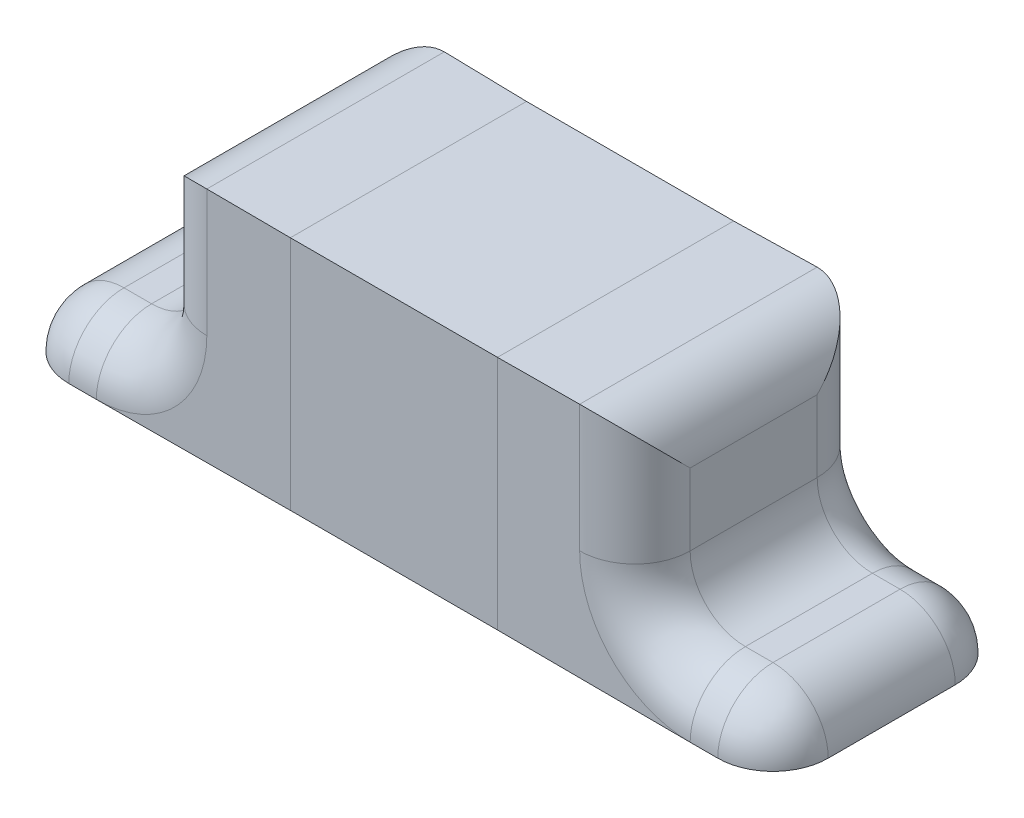
ISO-10303-21;
HEADER;
FILE_DESCRIPTION(('STEP AP214'),'2;1');
FILE_NAME('part.step','',(''),(''),'','','');
FILE_SCHEMA(('AUTOMOTIVE_DESIGN { 1 0 10303 214 1 1 1 1 }'));
ENDSEC;
DATA;
#1=APPLICATION_CONTEXT('core data for automotive mechanical design processes');
#2=APPLICATION_PROTOCOL_DEFINITION('international standard','automotive_design',2000,#1);
#3=PRODUCT_CONTEXT('',#1,'mechanical');
#4=PRODUCT('Part','Part','',(#3));
#5=PRODUCT_RELATED_PRODUCT_CATEGORY('part','',(#4));
#6=PRODUCT_DEFINITION_FORMATION('','',#4);
#7=PRODUCT_DEFINITION_CONTEXT('part definition',#1,'design');
#8=PRODUCT_DEFINITION('design','',#6,#7);
#9=PRODUCT_DEFINITION_SHAPE('','',#8);
#10=(LENGTH_UNIT() NAMED_UNIT(*) SI_UNIT(.MILLI.,.METRE.));
#11=(NAMED_UNIT(*) PLANE_ANGLE_UNIT() SI_UNIT($,.RADIAN.));
#12=(NAMED_UNIT(*) SI_UNIT($,.STERADIAN.) SOLID_ANGLE_UNIT());
#13=UNCERTAINTY_MEASURE_WITH_UNIT(LENGTH_MEASURE(1.E-05),#10,'distance_accuracy_value','');
#14=(GEOMETRIC_REPRESENTATION_CONTEXT(3) GLOBAL_UNCERTAINTY_ASSIGNED_CONTEXT((#13)) GLOBAL_UNIT_ASSIGNED_CONTEXT((#10,
#11,#12)) REPRESENTATION_CONTEXT('',''));
#15=CARTESIAN_POINT('',(0.,0.,0.));
#16=DIRECTION('',(0.,0.,1.));
#17=DIRECTION('',(1.,0.,0.));
#18=AXIS2_PLACEMENT_3D('',#15,#16,#17);
#19=CARTESIAN_POINT('',(-1.175,-0.00155700990971797,0.23));
#20=DIRECTION('',(0.,1.,0.));
#21=DIRECTION('',(1.,0.,0.));
#22=AXIS2_PLACEMENT_3D('',#19,#20,#21);
#23=SPHERICAL_SURFACE('',#22,0.2);
#24=CARTESIAN_POINT('',(-1.175,-0.00155700990971796,0.23));
#25=DIRECTION('',(0.,-1.,0.));
#26=DIRECTION('',(0.,0.,-1.));
#27=AXIS2_PLACEMENT_3D('',#24,#25,#26);
#28=CIRCLE('',#27,0.2);
#29=CARTESIAN_POINT('',(-1.175,-0.00155700990971797,0.43));
#30=VERTEX_POINT('',#29);
#31=CARTESIAN_POINT('',(-1.375,-0.00155700990971797,0.23));
#32=VERTEX_POINT('',#31);
#33=EDGE_CURVE('E244',#30,#32,#28,.T.);
#34=ORIENTED_EDGE('',*,*,#33,.F.);
#35=CARTESIAN_POINT('',(-1.175,-0.00155700990971797,0.23));
#36=DIRECTION('',(1.,0.,0.));
#37=DIRECTION('',(0.,0.,-1.));
#38=AXIS2_PLACEMENT_3D('',#35,#36,#37);
#39=CIRCLE('',#38,0.2);
#40=CARTESIAN_POINT('',(-1.175,0.198442990090282,0.23));
#41=VERTEX_POINT('',#40);
#42=EDGE_CURVE('E261',#41,#30,#39,.T.);
#43=ORIENTED_EDGE('',*,*,#42,.F.);
#44=CARTESIAN_POINT('',(-1.175,-0.00155700990971797,0.23));
#45=DIRECTION('',(0.,0.,-1.));
#46=DIRECTION('',(-1.,0.,0.));
#47=AXIS2_PLACEMENT_3D('',#44,#45,#46);
#48=CIRCLE('',#47,0.2);
#49=EDGE_CURVE('E221',#32,#41,#48,.T.);
#50=ORIENTED_EDGE('',*,*,#49,.F.);
#51=EDGE_LOOP('',(#34,#43,#50));
#52=FACE_BOUND('',#51,.T.);
#53=ADVANCED_FACE('F18',(#52),#23,.T.);
#54=CARTESIAN_POINT('',(-1.175,-0.00155700990971797,-0.23));
#55=DIRECTION('',(0.,1.,0.));
#56=DIRECTION('',(1.,0.,0.));
#57=AXIS2_PLACEMENT_3D('',#54,#55,#56);
#58=SPHERICAL_SURFACE('',#57,0.2);
#59=CARTESIAN_POINT('',(-1.175,-0.00155700990971793,-0.23));
#60=DIRECTION('',(0.,-1.,0.));
#61=DIRECTION('',(0.,0.,-1.));
#62=AXIS2_PLACEMENT_3D('',#59,#60,#61);
#63=CIRCLE('',#62,0.2);
#64=CARTESIAN_POINT('',(-1.375,-0.00155700990971797,-0.23));
#65=VERTEX_POINT('',#64);
#66=CARTESIAN_POINT('',(-1.175,-0.00155700990971791,-0.43));
#67=VERTEX_POINT('',#66);
#68=EDGE_CURVE('E537',#65,#67,#63,.T.);
#69=ORIENTED_EDGE('',*,*,#68,.F.);
#70=CARTESIAN_POINT('',(-1.175,-0.00155700990971797,-0.23));
#71=DIRECTION('',(0.,0.,1.));
#72=DIRECTION('',(-1.,0.,0.));
#73=AXIS2_PLACEMENT_3D('',#70,#71,#72);
#74=CIRCLE('',#73,0.2);
#75=CARTESIAN_POINT('',(-1.175,0.198442990090282,-0.23));
#76=VERTEX_POINT('',#75);
#77=EDGE_CURVE('E615',#76,#65,#74,.T.);
#78=ORIENTED_EDGE('',*,*,#77,.F.);
#79=CARTESIAN_POINT('',(-1.175,-0.00155700990971797,-0.23));
#80=DIRECTION('',(1.,0.,0.));
#81=DIRECTION('',(0.,0.,-1.));
#82=AXIS2_PLACEMENT_3D('',#79,#80,#81);
#83=CIRCLE('',#82,0.2);
#84=EDGE_CURVE('E46',#67,#76,#83,.T.);
#85=ORIENTED_EDGE('',*,*,#84,.F.);
#86=EDGE_LOOP('',(#69,#78,#85));
#87=FACE_BOUND('',#86,.T.);
#88=ADVANCED_FACE('F796',(#87),#58,.T.);
#89=CARTESIAN_POINT('',(-0.675,-0.00155700990971791,-0.23));
#90=DIRECTION('',(0.,-1.,0.));
#91=DIRECTION('',(0.,0.,-1.));
#92=AXIS2_PLACEMENT_3D('',#89,#90,#91);
#93=CYLINDRICAL_SURFACE('',#92,0.2);
#94=CARTESIAN_POINT('',(-0.675,0.398442990090282,-0.23));
#95=DIRECTION('',(0.,1.,0.));
#96=DIRECTION('',(0.,0.,-1.));
#97=AXIS2_PLACEMENT_3D('',#94,#95,#96);
#98=CIRCLE('',#97,0.2);
#99=CARTESIAN_POINT('',(-0.675,0.398442990090282,-0.43));
#100=VERTEX_POINT('',#99);
#101=CARTESIAN_POINT('',(-0.875,0.398442990090282,-0.23));
#102=VERTEX_POINT('',#101);
#103=EDGE_CURVE('E31',#100,#102,#98,.T.);
#104=ORIENTED_EDGE('',*,*,#103,.T.);
#105=DIRECTION('',(0.,-1.,0.));
#106=VECTOR('',#105,1.);
#107=CARTESIAN_POINT('',(-0.875,0.198442990090282,-0.23));
#108=LINE('',#107,#106);
#109=CARTESIAN_POINT('',(-0.875,0.658442990090282,-0.23));
#110=VERTEX_POINT('',#109);
#111=EDGE_CURVE('E254',#110,#102,#108,.T.);
#112=ORIENTED_EDGE('',*,*,#111,.F.);
#113=CARTESIAN_POINT('',(-0.875,0.658442990090282,-0.23));
#114=CARTESIAN_POINT('',(-0.875,0.775600277615663,-0.347157287525381));
#115=CARTESIAN_POINT('',(-0.792157287525382,0.858442990090282,-0.43));
#116=CARTESIAN_POINT('',(-0.675,0.858442990090282,-0.43));
#117=(BOUNDED_CURVE() B_SPLINE_CURVE(3,(#113,#114,#115,#116),.UNSPECIFIED.,.F.,
.F.) B_SPLINE_CURVE_WITH_KNOTS((4,4),(4.71238898038469,6.28318530717959),
.UNSPECIFIED.) CURVE() GEOMETRIC_REPRESENTATION_ITEM() RATIONAL_B_SPLINE_CURVE((1.,
0.804737854124365,0.804737854124365,1.)) REPRESENTATION_ITEM(''));
#118=CARTESIAN_POINT('',(-0.675,0.858442990090282,-0.43));
#119=VERTEX_POINT('',#118);
#120=EDGE_CURVE('E11',#110,#119,#117,.T.);
#121=ORIENTED_EDGE('',*,*,#120,.T.);
#122=DIRECTION('',(0.,1.,0.));
#123=VECTOR('',#122,1.);
#124=CARTESIAN_POINT('',(-0.675,0.858442990090282,-0.43));
#125=LINE('',#124,#123);
#126=EDGE_CURVE('E328',#100,#119,#125,.T.);
#127=ORIENTED_EDGE('',*,*,#126,.F.);
#128=EDGE_LOOP('',(#104,#112,#121,#127));
#129=FACE_BOUND('',#128,.T.);
#130=ADVANCED_FACE('F410',(#129),#93,.T.);
#131=CARTESIAN_POINT('',(-0.675,0.658442990090282,0.43));
#132=DIRECTION('',(0.,0.,-1.));
#133=DIRECTION('',(-1.,0.,0.));
#134=AXIS2_PLACEMENT_3D('',#131,#132,#133);
#135=CYLINDRICAL_SURFACE('',#134,0.2);
#136=CARTESIAN_POINT('',(-0.875,0.658442990090282,0.23));
#137=CARTESIAN_POINT('',(-0.875,0.775600277615663,0.347157287525381));
#138=CARTESIAN_POINT('',(-0.792157287525382,0.858442990090282,0.43));
#139=CARTESIAN_POINT('',(-0.675,0.858442990090282,0.43));
#140=(BOUNDED_CURVE() B_SPLINE_CURVE(3,(#136,#137,#138,#139),.UNSPECIFIED.,.F.,
.F.) B_SPLINE_CURVE_WITH_KNOTS((4,4),(1.5707963267949,3.1415926535898),
.UNSPECIFIED.) CURVE() GEOMETRIC_REPRESENTATION_ITEM() RATIONAL_B_SPLINE_CURVE((1.,
0.804737854124365,0.804737854124365,1.)) REPRESENTATION_ITEM(''));
#141=CARTESIAN_POINT('',(-0.875,0.658442990090282,0.23));
#142=VERTEX_POINT('',#141);
#143=CARTESIAN_POINT('',(-0.675,0.858442990090282,0.43));
#144=VERTEX_POINT('',#143);
#145=EDGE_CURVE('E530',#142,#144,#140,.T.);
#146=ORIENTED_EDGE('',*,*,#145,.T.);
#147=DIRECTION('',(0.,0.,1.));
#148=VECTOR('',#147,1.);
#149=CARTESIAN_POINT('',(-0.675,0.858442990090282,0.43));
#150=LINE('',#149,#148);
#151=EDGE_CURVE('E233',#119,#144,#150,.T.);
#152=ORIENTED_EDGE('',*,*,#151,.F.);
#153=ORIENTED_EDGE('',*,*,#120,.F.);
#154=DIRECTION('',(0.,0.,-1.));
#155=VECTOR('',#154,1.);
#156=CARTESIAN_POINT('',(-0.875,0.658442990090282,-0.43));
#157=LINE('',#156,#155);
#158=EDGE_CURVE('E616',#142,#110,#157,.T.);
#159=ORIENTED_EDGE('',*,*,#158,.F.);
#160=EDGE_LOOP('',(#146,#152,#153,#159));
#161=FACE_BOUND('',#160,.T.);
#162=ADVANCED_FACE('F406',(#161),#135,.T.);
#163=CARTESIAN_POINT('',(-1.075,0.398442990090282,-0.23));
#164=DIRECTION('',(0.,0.,-1.));
#165=DIRECTION('',(-1.,0.,0.));
#166=AXIS2_PLACEMENT_3D('',#163,#164,#165);
#167=TOROIDAL_SURFACE('',#166,0.4,0.2);
#168=CARTESIAN_POINT('',(-1.075,-0.00155700990971797,-0.23));
#169=DIRECTION('',(1.,0.,0.));
#170=DIRECTION('',(0.,0.,-1.));
#171=AXIS2_PLACEMENT_3D('',#168,#169,#170);
#172=CIRCLE('',#171,0.2);
#173=CARTESIAN_POINT('',(-1.075,-0.00155700990971791,-0.43));
#174=VERTEX_POINT('',#173);
#175=CARTESIAN_POINT('',(-1.075,0.198442990090282,-0.23));
#176=VERTEX_POINT('',#175);
#177=EDGE_CURVE('E684',#174,#176,#172,.T.);
#178=ORIENTED_EDGE('',*,*,#177,.T.);
#179=CARTESIAN_POINT('',(-1.075,0.398442990090282,-0.23));
#180=DIRECTION('',(0.,0.,1.));
#181=DIRECTION('',(-1.,0.,0.));
#182=AXIS2_PLACEMENT_3D('',#179,#180,#181);
#183=CIRCLE('',#182,0.2);
#184=EDGE_CURVE('E266',#176,#102,#183,.T.);
#185=ORIENTED_EDGE('',*,*,#184,.T.);
#186=ORIENTED_EDGE('',*,*,#103,.F.);
#187=CARTESIAN_POINT('',(-1.075,0.398442990090282,-0.43));
#188=DIRECTION('',(0.,0.,-1.));
#189=DIRECTION('',(-1.,0.,0.));
#190=AXIS2_PLACEMENT_3D('',#187,#188,#189);
#191=CIRCLE('',#190,0.4);
#192=EDGE_CURVE('E601',#100,#174,#191,.T.);
#193=ORIENTED_EDGE('',*,*,#192,.T.);
#194=EDGE_LOOP('',(#178,#185,#186,#193));
#195=FACE_BOUND('',#194,.T.);
#196=ADVANCED_FACE('F409',(#195),#167,.T.);
#197=CARTESIAN_POINT('',(-0.675,-0.00155700990971797,0.23));
#198=DIRECTION('',(0.,1.,0.));
#199=DIRECTION('',(0.,0.,1.));
#200=AXIS2_PLACEMENT_3D('',#197,#198,#199);
#201=CYLINDRICAL_SURFACE('',#200,0.2);
#202=CARTESIAN_POINT('',(-0.675,0.398442990090282,0.23));
#203=DIRECTION('',(0.,1.,0.));
#204=DIRECTION('',(0.,0.,-1.));
#205=AXIS2_PLACEMENT_3D('',#202,#203,#204);
#206=CIRCLE('',#205,0.2);
#207=CARTESIAN_POINT('',(-0.875,0.398442990090282,0.23));
#208=VERTEX_POINT('',#207);
#209=CARTESIAN_POINT('',(-0.675,0.398442990090282,0.43));
#210=VERTEX_POINT('',#209);
#211=EDGE_CURVE('E210',#208,#210,#206,.T.);
#212=ORIENTED_EDGE('',*,*,#211,.T.);
#213=DIRECTION('',(0.,-1.,0.));
#214=VECTOR('',#213,1.);
#215=CARTESIAN_POINT('',(-0.675,0.198442990090282,0.43));
#216=LINE('',#215,#214);
#217=EDGE_CURVE('E214',#144,#210,#216,.T.);
#218=ORIENTED_EDGE('',*,*,#217,.F.);
#219=ORIENTED_EDGE('',*,*,#145,.F.);
#220=DIRECTION('',(0.,1.,0.));
#221=VECTOR('',#220,1.);
#222=CARTESIAN_POINT('',(-0.875,0.858442990090282,0.23));
#223=LINE('',#222,#221);
#224=EDGE_CURVE('E217',#208,#142,#223,.T.);
#225=ORIENTED_EDGE('',*,*,#224,.F.);
#226=EDGE_LOOP('',(#212,#218,#219,#225));
#227=FACE_BOUND('',#226,.T.);
#228=ADVANCED_FACE('F212',(#227),#201,.T.);
#229=CARTESIAN_POINT('',(-0.875,-0.00155700990971797,-0.23));
#230=DIRECTION('',(1.,0.,0.));
#231=DIRECTION('',(0.,0.,-1.));
#232=AXIS2_PLACEMENT_3D('',#229,#230,#231);
#233=CYLINDRICAL_SURFACE('',#232,0.2);
#234=DIRECTION('',(1.,0.,0.));
#235=VECTOR('',#234,1.);
#236=CARTESIAN_POINT('',(-0.875,-0.00155700990971791,-0.43));
#237=LINE('',#236,#235);
#238=EDGE_CURVE('E301',#67,#174,#237,.T.);
#239=ORIENTED_EDGE('',*,*,#238,.F.);
#240=ORIENTED_EDGE('',*,*,#84,.T.);
#241=DIRECTION('',(-1.,0.,0.));
#242=VECTOR('',#241,1.);
#243=CARTESIAN_POINT('',(-1.375,0.198442990090282,-0.23));
#244=LINE('',#243,#242);
#245=EDGE_CURVE('E280',#176,#76,#244,.T.);
#246=ORIENTED_EDGE('',*,*,#245,.F.);
#247=ORIENTED_EDGE('',*,*,#177,.F.);
#248=EDGE_LOOP('',(#239,#240,#246,#247));
#249=FACE_BOUND('',#248,.T.);
#250=ADVANCED_FACE('F475',(#249),#233,.T.);
#251=CARTESIAN_POINT('',(-1.075,0.398442990090282,0.));
#252=DIRECTION('',(0.,0.,1.));
#253=DIRECTION('',(1.,0.,0.));
#254=AXIS2_PLACEMENT_3D('',#251,#252,#253);
#255=CYLINDRICAL_SURFACE('',#254,0.2);
#256=CARTESIAN_POINT('',(-1.075,0.398442990090282,0.23));
#257=DIRECTION('',(0.,0.,1.));
#258=DIRECTION('',(1.,0.,0.));
#259=AXIS2_PLACEMENT_3D('',#256,#257,#258);
#260=CIRCLE('',#259,0.2);
#261=CARTESIAN_POINT('',(-1.075,0.198442990090282,0.23));
#262=VERTEX_POINT('',#261);
#263=EDGE_CURVE('E199',#262,#208,#260,.T.);
#264=ORIENTED_EDGE('',*,*,#263,.T.);
#265=DIRECTION('',(0.,0.,1.));
#266=VECTOR('',#265,1.);
#267=CARTESIAN_POINT('',(-0.875,0.398442990090282,0.));
#268=LINE('',#267,#266);
#269=EDGE_CURVE('E250',#102,#208,#268,.T.);
#270=ORIENTED_EDGE('',*,*,#269,.F.);
#271=ORIENTED_EDGE('',*,*,#184,.F.);
#272=DIRECTION('',(0.,0.,-1.));
#273=VECTOR('',#272,1.);
#274=CARTESIAN_POINT('',(-1.075,0.198442990090282,0.43));
#275=LINE('',#274,#273);
#276=EDGE_CURVE('E276',#262,#176,#275,.T.);
#277=ORIENTED_EDGE('',*,*,#276,.F.);
#278=EDGE_LOOP('',(#264,#270,#271,#277));
#279=FACE_BOUND('',#278,.T.);
#280=ADVANCED_FACE('F478',(#279),#255,.F.);
#281=CARTESIAN_POINT('',(-1.075,0.398442990090282,0.23));
#282=DIRECTION('',(0.,0.,1.));
#283=DIRECTION('',(1.,0.,0.));
#284=AXIS2_PLACEMENT_3D('',#281,#282,#283);
#285=TOROIDAL_SURFACE('',#284,0.4,0.2);
#286=ORIENTED_EDGE('',*,*,#211,.F.);
#287=ORIENTED_EDGE('',*,*,#263,.F.);
#288=CARTESIAN_POINT('',(-1.075,-0.00155700990971797,0.23));
#289=DIRECTION('',(1.,0.,0.));
#290=DIRECTION('',(0.,0.,-1.));
#291=AXIS2_PLACEMENT_3D('',#288,#289,#290);
#292=CIRCLE('',#291,0.2);
#293=CARTESIAN_POINT('',(-1.075,-0.00155700990971797,0.43));
#294=VERTEX_POINT('',#293);
#295=EDGE_CURVE('E228',#262,#294,#292,.T.);
#296=ORIENTED_EDGE('',*,*,#295,.T.);
#297=CARTESIAN_POINT('',(-1.075,0.398442990090282,0.43));
#298=DIRECTION('',(0.,0.,1.));
#299=DIRECTION('',(1.,0.,0.));
#300=AXIS2_PLACEMENT_3D('',#297,#298,#299);
#301=CIRCLE('',#300,0.4);
#302=EDGE_CURVE('E225',#294,#210,#301,.T.);
#303=ORIENTED_EDGE('',*,*,#302,.T.);
#304=EDGE_LOOP('',(#286,#287,#296,#303));
#305=FACE_BOUND('',#304,.T.);
#306=ADVANCED_FACE('F226',(#305),#285,.T.);
#307=CARTESIAN_POINT('',(-1.175,-0.00155700990971797,0.43));
#308=DIRECTION('',(0.,0.,-1.));
#309=DIRECTION('',(-1.,0.,0.));
#310=AXIS2_PLACEMENT_3D('',#307,#308,#309);
#311=CYLINDRICAL_SURFACE('',#310,0.2);
#312=DIRECTION('',(0.,0.,1.));
#313=VECTOR('',#312,1.);
#314=CARTESIAN_POINT('',(-1.175,0.198442990090282,0.43));
#315=LINE('',#314,#313);
#316=EDGE_CURVE('E265',#76,#41,#315,.T.);
#317=ORIENTED_EDGE('',*,*,#316,.F.);
#318=ORIENTED_EDGE('',*,*,#77,.T.);
#319=DIRECTION('',(0.,0.,-1.));
#320=VECTOR('',#319,1.);
#321=CARTESIAN_POINT('',(-1.375,-0.00155700990971797,0.43));
#322=LINE('',#321,#320);
#323=EDGE_CURVE('E315',#32,#65,#322,.T.);
#324=ORIENTED_EDGE('',*,*,#323,.F.);
#325=ORIENTED_EDGE('',*,*,#49,.T.);
#326=EDGE_LOOP('',(#317,#318,#324,#325));
#327=FACE_BOUND('',#326,.T.);
#328=ADVANCED_FACE('F470',(#327),#311,.T.);
#329=CARTESIAN_POINT('',(-1.375,-0.00155700990971797,0.23));
#330=DIRECTION('',(1.,0.,0.));
#331=DIRECTION('',(0.,0.,-1.));
#332=AXIS2_PLACEMENT_3D('',#329,#330,#331);
#333=CYLINDRICAL_SURFACE('',#332,0.2);
#334=DIRECTION('',(1.,0.,0.));
#335=VECTOR('',#334,1.);
#336=CARTESIAN_POINT('',(-1.375,0.198442990090282,0.23));
#337=LINE('',#336,#335);
#338=EDGE_CURVE('E253',#41,#262,#337,.T.);
#339=ORIENTED_EDGE('',*,*,#338,.F.);
#340=ORIENTED_EDGE('',*,*,#42,.T.);
#341=DIRECTION('',(1.,0.,0.));
#342=VECTOR('',#341,1.);
#343=CARTESIAN_POINT('',(-0.875,-0.00155700990971797,0.43));
#344=LINE('',#343,#342);
#345=EDGE_CURVE('E300',#30,#294,#344,.T.);
#346=ORIENTED_EDGE('',*,*,#345,.T.);
#347=ORIENTED_EDGE('',*,*,#295,.F.);
#348=EDGE_LOOP('',(#339,#340,#346,#347));
#349=FACE_BOUND('',#348,.T.);
#350=ADVANCED_FACE('F473',(#349),#333,.T.);
#351=CARTESIAN_POINT('',(-1.375,0.198442990090282,0.43));
#352=DIRECTION('',(0.,1.,0.));
#353=DIRECTION('',(1.,0.,0.));
#354=AXIS2_PLACEMENT_3D('',#351,#352,#353);
#355=PLANE('',#354);
#356=ORIENTED_EDGE('',*,*,#338,.T.);
#357=ORIENTED_EDGE('',*,*,#276,.T.);
#358=ORIENTED_EDGE('',*,*,#245,.T.);
#359=ORIENTED_EDGE('',*,*,#316,.T.);
#360=EDGE_LOOP('',(#356,#357,#358,#359));
#361=FACE_BOUND('',#360,.T.);
#362=ADVANCED_FACE('F453',(#361),#355,.T.);
#363=CARTESIAN_POINT('',(-0.875,0.,0.));
#364=DIRECTION('',(1.,0.,0.));
#365=DIRECTION('',(0.,1.,0.));
#366=AXIS2_PLACEMENT_3D('',#363,#364,#365);
#367=PLANE('',#366);
#368=ORIENTED_EDGE('',*,*,#224,.T.);
#369=ORIENTED_EDGE('',*,*,#158,.T.);
#370=ORIENTED_EDGE('',*,*,#111,.T.);
#371=ORIENTED_EDGE('',*,*,#269,.T.);
#372=EDGE_LOOP('',(#368,#369,#370,#371));
#373=FACE_BOUND('',#372,.T.);
#374=ADVANCED_FACE('F745',(#373),#367,.F.);
#375=CARTESIAN_POINT('',(-0.875,0.858442990090282,0.43));
#376=DIRECTION('',(0.,1.,0.));
#377=DIRECTION('',(1.,0.,0.));
#378=AXIS2_PLACEMENT_3D('',#375,#376,#377);
#379=PLANE('',#378);
#380=DIRECTION('',(1.,0.,0.));
#381=VECTOR('',#380,1.);
#382=CARTESIAN_POINT('',(-0.875,0.858442990090282,-0.43));
#383=LINE('',#382,#381);
#384=CARTESIAN_POINT('',(-0.375,0.854221495045141,-0.4275));
#385=VERTEX_POINT('',#384);
#386=EDGE_CURVE('E316',#119,#385,#383,.T.);
#387=ORIENTED_EDGE('',*,*,#386,.F.);
#388=ORIENTED_EDGE('',*,*,#151,.T.);
#389=DIRECTION('',(1.,0.,0.));
#390=VECTOR('',#389,1.);
#391=CARTESIAN_POINT('',(-0.875,0.858442990090282,0.43));
#392=LINE('',#391,#390);
#393=CARTESIAN_POINT('',(-0.375,0.854221495045141,0.4275));
#394=VERTEX_POINT('',#393);
#395=EDGE_CURVE('E237',#144,#394,#392,.T.);
#396=ORIENTED_EDGE('',*,*,#395,.T.);
#397=CARTESIAN_POINT('',(-0.375,0.85,-0.4275));
#398=DIRECTION('',(0.,0.,1.));
#399=VECTOR('',#398,1.);
#400=LINE('',#397,#399);
#401=EDGE_CURVE('E294',#385,#394,#400,.T.);
#402=ORIENTED_EDGE('',*,*,#401,.F.);
#403=EDGE_LOOP('',(#387,#388,#396,#402));
#404=FACE_BOUND('',#403,.T.);
#405=ADVANCED_FACE('F736',(#404),#379,.T.);
#406=CARTESIAN_POINT('',(-0.875,-0.00155700990971797,0.43));
#407=DIRECTION('',(0.,0.,1.));
#408=DIRECTION('',(1.,0.,0.));
#409=AXIS2_PLACEMENT_3D('',#406,#407,#408);
#410=PLANE('',#409);
#411=ORIENTED_EDGE('',*,*,#395,.F.);
#412=ORIENTED_EDGE('',*,*,#217,.T.);
#413=ORIENTED_EDGE('',*,*,#302,.F.);
#414=DIRECTION('',(1.,0.,0.));
#415=VECTOR('',#414,1.);
#416=CARTESIAN_POINT('',(-0.875,-0.00155700990971797,0.43));
#417=LINE('',#416,#415);
#418=CARTESIAN_POINT('',(-0.375,-0.000778504954858524,0.4275));
#419=VERTEX_POINT('',#418);
#420=EDGE_CURVE('E297',#294,#419,#417,.T.);
#421=ORIENTED_EDGE('',*,*,#420,.T.);
#422=CARTESIAN_POINT('',(-0.375,0.854221495045142,0.425));
#423=DIRECTION('',(0.,-1.,0.));
#424=VECTOR('',#423,1.);
#425=LINE('',#422,#424);
#426=EDGE_CURVE('E309',#394,#419,#425,.T.);
#427=ORIENTED_EDGE('',*,*,#426,.F.);
#428=EDGE_LOOP('',(#411,#412,#413,#421,#427));
#429=FACE_BOUND('',#428,.T.);
#430=ADVANCED_FACE('F235',(#429),#410,.T.);
#431=CARTESIAN_POINT('',(-0.875,-0.00155700990971797,0.43));
#432=DIRECTION('',(0.,-1.,0.));
#433=DIRECTION('',(0.,0.,-1.));
#434=AXIS2_PLACEMENT_3D('',#431,#432,#433);
#435=PLANE('',#434);
#436=ORIENTED_EDGE('',*,*,#323,.T.);
#437=ORIENTED_EDGE('',*,*,#68,.T.);
#438=ORIENTED_EDGE('',*,*,#238,.T.);
#439=DIRECTION('',(1.,0.,0.));
#440=VECTOR('',#439,1.);
#441=CARTESIAN_POINT('',(-0.875,-0.00155700990971791,-0.43));
#442=LINE('',#441,#440);
#443=CARTESIAN_POINT('',(-0.375,-0.000778504954858497,-0.4275));
#444=VERTEX_POINT('',#443);
#445=EDGE_CURVE('E312',#174,#444,#442,.T.);
#446=ORIENTED_EDGE('',*,*,#445,.T.);
#447=CARTESIAN_POINT('',(-0.375,0.,0.4275));
#448=DIRECTION('',(0.,0.,-1.));
#449=VECTOR('',#448,1.);
#450=LINE('',#447,#449);
#451=EDGE_CURVE('E437',#419,#444,#450,.T.);
#452=ORIENTED_EDGE('',*,*,#451,.F.);
#453=ORIENTED_EDGE('',*,*,#420,.F.);
#454=ORIENTED_EDGE('',*,*,#345,.F.);
#455=ORIENTED_EDGE('',*,*,#33,.T.);
#456=EDGE_LOOP('',(#436,#437,#438,#446,#452,#453,#454,#455));
#457=FACE_BOUND('',#456,.T.);
#458=ADVANCED_FACE('F404',(#457),#435,.T.);
#459=CARTESIAN_POINT('',(-0.875,-0.00155700990971791,-0.43));
#460=DIRECTION('',(0.,0.,-1.));
#461=DIRECTION('',(0.,-1.,0.));
#462=AXIS2_PLACEMENT_3D('',#459,#460,#461);
#463=PLANE('',#462);
#464=ORIENTED_EDGE('',*,*,#192,.F.);
#465=ORIENTED_EDGE('',*,*,#126,.T.);
#466=ORIENTED_EDGE('',*,*,#386,.T.);
#467=CARTESIAN_POINT('',(-0.375,-0.000778504954858497,-0.425));
#468=DIRECTION('',(0.,1.,0.));
#469=VECTOR('',#468,1.);
#470=LINE('',#467,#469);
#471=EDGE_CURVE('E335',#444,#385,#470,.T.);
#472=ORIENTED_EDGE('',*,*,#471,.F.);
#473=ORIENTED_EDGE('',*,*,#445,.F.);
#474=EDGE_LOOP('',(#464,#465,#466,#472,#473));
#475=FACE_BOUND('',#474,.T.);
#476=ADVANCED_FACE('F399',(#475),#463,.T.);
#477=CARTESIAN_POINT('',(1.175,-0.00155700990971797,0.23));
#478=DIRECTION('',(0.,1.,0.));
#479=DIRECTION('',(1.,0.,0.));
#480=AXIS2_PLACEMENT_3D('',#477,#478,#479);
#481=SPHERICAL_SURFACE('',#480,0.2);
#482=CARTESIAN_POINT('',(1.175,-0.00155700990971797,0.23));
#483=DIRECTION('',(0.,0.,-1.));
#484=DIRECTION('',(1.,0.,0.));
#485=AXIS2_PLACEMENT_3D('',#482,#483,#484);
#486=CIRCLE('',#485,0.2);
#487=CARTESIAN_POINT('',(1.175,0.198442990090282,0.23));
#488=VERTEX_POINT('',#487);
#489=CARTESIAN_POINT('',(1.375,-0.00155700990971797,0.23));
#490=VERTEX_POINT('',#489);
#491=EDGE_CURVE('E590',#488,#490,#486,.T.);
#492=ORIENTED_EDGE('',*,*,#491,.F.);
#493=CARTESIAN_POINT('',(1.175,-0.00155700990971797,0.23));
#494=DIRECTION('',(-1.,0.,0.));
#495=DIRECTION('',(0.,0.,1.));
#496=AXIS2_PLACEMENT_3D('',#493,#494,#495);
#497=CIRCLE('',#496,0.2);
#498=CARTESIAN_POINT('',(1.175,-0.00155700990971797,0.43));
#499=VERTEX_POINT('',#498);
#500=EDGE_CURVE('E270',#499,#488,#497,.T.);
#501=ORIENTED_EDGE('',*,*,#500,.F.);
#502=CARTESIAN_POINT('',(1.175,-0.00155700990971796,0.23));
#503=DIRECTION('',(0.,-1.,0.));
#504=DIRECTION('',(0.,0.,1.));
#505=AXIS2_PLACEMENT_3D('',#502,#503,#504);
#506=CIRCLE('',#505,0.2);
#507=EDGE_CURVE('E544',#490,#499,#506,.T.);
#508=ORIENTED_EDGE('',*,*,#507,.F.);
#509=EDGE_LOOP('',(#492,#501,#508));
#510=FACE_BOUND('',#509,.T.);
#511=ADVANCED_FACE('F403',(#510),#481,.T.);
#512=CARTESIAN_POINT('',(1.175,-0.00155700990971797,-0.23));
#513=DIRECTION('',(0.,1.,0.));
#514=DIRECTION('',(1.,0.,0.));
#515=AXIS2_PLACEMENT_3D('',#512,#513,#514);
#516=SPHERICAL_SURFACE('',#515,0.2);
#517=CARTESIAN_POINT('',(1.175,-0.00155700990971797,-0.23));
#518=DIRECTION('',(-1.,0.,0.));
#519=DIRECTION('',(0.,0.,1.));
#520=AXIS2_PLACEMENT_3D('',#517,#518,#519);
#521=CIRCLE('',#520,0.2);
#522=CARTESIAN_POINT('',(1.175,0.198442990090282,-0.23));
#523=VERTEX_POINT('',#522);
#524=CARTESIAN_POINT('',(1.175,-0.00155700990971791,-0.43));
#525=VERTEX_POINT('',#524);
#526=EDGE_CURVE('E260',#523,#525,#521,.T.);
#527=ORIENTED_EDGE('',*,*,#526,.F.);
#528=CARTESIAN_POINT('',(1.175,-0.00155700990971797,-0.23));
#529=DIRECTION('',(0.,0.,1.));
#530=DIRECTION('',(1.,0.,0.));
#531=AXIS2_PLACEMENT_3D('',#528,#529,#530);
#532=CIRCLE('',#531,0.2);
#533=CARTESIAN_POINT('',(1.375,-0.00155700990971797,-0.23));
#534=VERTEX_POINT('',#533);
#535=EDGE_CURVE('E593',#534,#523,#532,.T.);
#536=ORIENTED_EDGE('',*,*,#535,.F.);
#537=CARTESIAN_POINT('',(1.175,-0.00155700990971793,-0.23));
#538=DIRECTION('',(0.,-1.,0.));
#539=DIRECTION('',(0.,0.,1.));
#540=AXIS2_PLACEMENT_3D('',#537,#538,#539);
#541=CIRCLE('',#540,0.2);
#542=EDGE_CURVE('E553',#525,#534,#541,.T.);
#543=ORIENTED_EDGE('',*,*,#542,.F.);
#544=EDGE_LOOP('',(#527,#536,#543));
#545=FACE_BOUND('',#544,.T.);
#546=ADVANCED_FACE('F460',(#545),#516,.T.);
#547=CARTESIAN_POINT('',(0.675,0.,-0.23));
#548=DIRECTION('',(0.,1.,0.));
#549=DIRECTION('',(0.,0.,1.));
#550=AXIS2_PLACEMENT_3D('',#547,#548,#549);
#551=CYLINDRICAL_SURFACE('',#550,0.2);
#552=CARTESIAN_POINT('',(0.675,0.398442990090282,-0.23));
#553=DIRECTION('',(0.,1.,0.));
#554=DIRECTION('',(0.,0.,-1.));
#555=AXIS2_PLACEMENT_3D('',#552,#553,#554);
#556=CIRCLE('',#555,0.2);
#557=CARTESIAN_POINT('',(0.875,0.398442990090282,-0.23));
#558=VERTEX_POINT('',#557);
#559=CARTESIAN_POINT('',(0.675,0.398442990090282,-0.43));
#560=VERTEX_POINT('',#559);
#561=EDGE_CURVE('E561',#558,#560,#556,.T.);
#562=ORIENTED_EDGE('',*,*,#561,.T.);
#563=DIRECTION('',(0.,-1.,0.));
#564=VECTOR('',#563,1.);
#565=CARTESIAN_POINT('',(0.675,-0.00155700990971791,-0.43));
#566=LINE('',#565,#564);
#567=CARTESIAN_POINT('',(0.675,0.858442990090282,-0.43));
#568=VERTEX_POINT('',#567);
#569=EDGE_CURVE('E358',#568,#560,#566,.T.);
#570=ORIENTED_EDGE('',*,*,#569,.F.);
#571=CARTESIAN_POINT('',(0.675,0.858442990090282,-0.43));
#572=CARTESIAN_POINT('',(0.792157287525382,0.858442990090282,-0.43));
#573=CARTESIAN_POINT('',(0.875,0.775600277615663,-0.347157287525381));
#574=CARTESIAN_POINT('',(0.875,0.658442990090282,-0.23));
#575=(BOUNDED_CURVE() B_SPLINE_CURVE(3,(#571,#572,#573,#574),.UNSPECIFIED.,.F.,
.F.) B_SPLINE_CURVE_WITH_KNOTS((4,4),(3.1415926535898,4.71238898038469),
.UNSPECIFIED.) CURVE() GEOMETRIC_REPRESENTATION_ITEM() RATIONAL_B_SPLINE_CURVE((1.,
0.804737854124365,0.804737854124365,1.)) REPRESENTATION_ITEM(''));
#576=CARTESIAN_POINT('',(0.875,0.658442990090282,-0.23));
#577=VERTEX_POINT('',#576);
#578=EDGE_CURVE('E176',#568,#577,#575,.T.);
#579=ORIENTED_EDGE('',*,*,#578,.T.);
#580=DIRECTION('',(0.,1.,0.));
#581=VECTOR('',#580,1.);
#582=CARTESIAN_POINT('',(0.875,0.,-0.23));
#583=LINE('',#582,#581);
#584=EDGE_CURVE('E631',#558,#577,#583,.T.);
#585=ORIENTED_EDGE('',*,*,#584,.F.);
#586=EDGE_LOOP('',(#562,#570,#579,#585));
#587=FACE_BOUND('',#586,.T.);
#588=ADVANCED_FACE('F398',(#587),#551,.T.);
#589=CARTESIAN_POINT('',(0.675,0.658442990090282,0.));
#590=DIRECTION('',(0.,0.,1.));
#591=DIRECTION('',(1.,0.,0.));
#592=AXIS2_PLACEMENT_3D('',#589,#590,#591);
#593=CYLINDRICAL_SURFACE('',#592,0.2);
#594=CARTESIAN_POINT('',(0.675,0.858442990090282,0.43));
#595=CARTESIAN_POINT('',(0.792157287525382,0.858442990090282,0.43));
#596=CARTESIAN_POINT('',(0.875,0.775600277615663,0.347157287525381));
#597=CARTESIAN_POINT('',(0.875,0.658442990090282,0.23));
#598=(BOUNDED_CURVE() B_SPLINE_CURVE(3,(#594,#595,#596,#597),.UNSPECIFIED.,.F.,
.F.) B_SPLINE_CURVE_WITH_KNOTS((4,4),(0.,1.5707963267949),
.UNSPECIFIED.) CURVE() GEOMETRIC_REPRESENTATION_ITEM() RATIONAL_B_SPLINE_CURVE((1.,
0.804737854124365,0.804737854124365,1.)) REPRESENTATION_ITEM(''));
#599=CARTESIAN_POINT('',(0.675,0.858442990090282,0.43));
#600=VERTEX_POINT('',#599);
#601=CARTESIAN_POINT('',(0.875,0.658442990090282,0.23));
#602=VERTEX_POINT('',#601);
#603=EDGE_CURVE('E164',#600,#602,#598,.T.);
#604=ORIENTED_EDGE('',*,*,#603,.T.);
#605=DIRECTION('',(0.,0.,1.));
#606=VECTOR('',#605,1.);
#607=CARTESIAN_POINT('',(0.875,0.658442990090282,0.));
#608=LINE('',#607,#606);
#609=EDGE_CURVE('E526',#577,#602,#608,.T.);
#610=ORIENTED_EDGE('',*,*,#609,.F.);
#611=ORIENTED_EDGE('',*,*,#578,.F.);
#612=DIRECTION('',(0.,0.,-1.));
#613=VECTOR('',#612,1.);
#614=CARTESIAN_POINT('',(0.675,0.858442990090282,0.43));
#615=LINE('',#614,#613);
#616=EDGE_CURVE('E348',#600,#568,#615,.T.);
#617=ORIENTED_EDGE('',*,*,#616,.F.);
#618=EDGE_LOOP('',(#604,#610,#611,#617));
#619=FACE_BOUND('',#618,.T.);
#620=ADVANCED_FACE('F395',(#619),#593,.T.);
#621=CARTESIAN_POINT('',(1.075,0.398442990090282,-0.23));
#622=DIRECTION('',(0.,0.,1.));
#623=DIRECTION('',(1.,0.,0.));
#624=AXIS2_PLACEMENT_3D('',#621,#622,#623);
#625=TOROIDAL_SURFACE('',#624,0.4,0.2);
#626=CARTESIAN_POINT('',(1.075,-0.00155700990971797,-0.23));
#627=DIRECTION('',(-1.,0.,0.));
#628=DIRECTION('',(0.,0.,1.));
#629=AXIS2_PLACEMENT_3D('',#626,#627,#628);
#630=CIRCLE('',#629,0.2);
#631=CARTESIAN_POINT('',(1.075,0.198442990090282,-0.23));
#632=VERTEX_POINT('',#631);
#633=CARTESIAN_POINT('',(1.075,-0.00155700990971791,-0.43));
#634=VERTEX_POINT('',#633);
#635=EDGE_CURVE('E255',#632,#634,#630,.T.);
#636=ORIENTED_EDGE('',*,*,#635,.T.);
#637=CARTESIAN_POINT('',(1.075,0.398442990090282,-0.43));
#638=DIRECTION('',(0.,0.,-1.));
#639=DIRECTION('',(1.,0.,0.));
#640=AXIS2_PLACEMENT_3D('',#637,#638,#639);
#641=CIRCLE('',#640,0.4);
#642=EDGE_CURVE('E353',#634,#560,#641,.T.);
#643=ORIENTED_EDGE('',*,*,#642,.T.);
#644=ORIENTED_EDGE('',*,*,#561,.F.);
#645=CARTESIAN_POINT('',(1.075,0.398442990090282,-0.23));
#646=DIRECTION('',(0.,0.,1.));
#647=DIRECTION('',(1.,0.,0.));
#648=AXIS2_PLACEMENT_3D('',#645,#646,#647);
#649=CIRCLE('',#648,0.2);
#650=EDGE_CURVE('E259',#558,#632,#649,.T.);
#651=ORIENTED_EDGE('',*,*,#650,.T.);
#652=EDGE_LOOP('',(#636,#643,#644,#651));
#653=FACE_BOUND('',#652,.T.);
#654=ADVANCED_FACE('F397',(#653),#625,.T.);
#655=CARTESIAN_POINT('',(0.675,0.,0.23));
#656=DIRECTION('',(0.,-1.,0.));
#657=DIRECTION('',(0.,0.,-1.));
#658=AXIS2_PLACEMENT_3D('',#655,#656,#657);
#659=CYLINDRICAL_SURFACE('',#658,0.2);
#660=CARTESIAN_POINT('',(0.675,0.398442990090282,0.23));
#661=DIRECTION('',(0.,1.,0.));
#662=DIRECTION('',(0.,0.,-1.));
#663=AXIS2_PLACEMENT_3D('',#660,#661,#662);
#664=CIRCLE('',#663,0.2);
#665=CARTESIAN_POINT('',(0.675,0.398442990090282,0.43));
#666=VERTEX_POINT('',#665);
#667=CARTESIAN_POINT('',(0.875,0.398442990090282,0.23));
#668=VERTEX_POINT('',#667);
#669=EDGE_CURVE('E625',#666,#668,#664,.T.);
#670=ORIENTED_EDGE('',*,*,#669,.T.);
#671=DIRECTION('',(0.,-1.,0.));
#672=VECTOR('',#671,1.);
#673=CARTESIAN_POINT('',(0.875,0.,0.23));
#674=LINE('',#673,#672);
#675=EDGE_CURVE('E517',#602,#668,#674,.T.);
#676=ORIENTED_EDGE('',*,*,#675,.F.);
#677=ORIENTED_EDGE('',*,*,#603,.F.);
#678=DIRECTION('',(0.,1.,0.));
#679=VECTOR('',#678,1.);
#680=CARTESIAN_POINT('',(0.675,-0.00155700990971797,0.43));
#681=LINE('',#680,#679);
#682=EDGE_CURVE('E342',#666,#600,#681,.T.);
#683=ORIENTED_EDGE('',*,*,#682,.F.);
#684=EDGE_LOOP('',(#670,#676,#677,#683));
#685=FACE_BOUND('',#684,.T.);
#686=ADVANCED_FACE('F458',(#685),#659,.T.);
#687=CARTESIAN_POINT('',(1.075,0.398442990090282,0.43));
#688=DIRECTION('',(0.,0.,-1.));
#689=DIRECTION('',(-1.,0.,0.));
#690=AXIS2_PLACEMENT_3D('',#687,#688,#689);
#691=CYLINDRICAL_SURFACE('',#690,0.2);
#692=CARTESIAN_POINT('',(1.075,0.398442990090282,0.23));
#693=DIRECTION('',(0.,0.,1.));
#694=DIRECTION('',(-1.,0.,0.));
#695=AXIS2_PLACEMENT_3D('',#692,#693,#694);
#696=CIRCLE('',#695,0.2);
#697=CARTESIAN_POINT('',(1.075,0.198442990090282,0.23));
#698=VERTEX_POINT('',#697);
#699=EDGE_CURVE('E248',#668,#698,#696,.T.);
#700=ORIENTED_EDGE('',*,*,#699,.T.);
#701=DIRECTION('',(0.,0.,1.));
#702=VECTOR('',#701,1.);
#703=CARTESIAN_POINT('',(1.075,0.198442990090282,0.43));
#704=LINE('',#703,#702);
#705=EDGE_CURVE('E281',#632,#698,#704,.T.);
#706=ORIENTED_EDGE('',*,*,#705,.F.);
#707=ORIENTED_EDGE('',*,*,#650,.F.);
#708=DIRECTION('',(0.,0.,-1.));
#709=VECTOR('',#708,1.);
#710=CARTESIAN_POINT('',(0.875,0.398442990090282,-0.43));
#711=LINE('',#710,#709);
#712=EDGE_CURVE('E512',#668,#558,#711,.T.);
#713=ORIENTED_EDGE('',*,*,#712,.F.);
#714=EDGE_LOOP('',(#700,#706,#707,#713));
#715=FACE_BOUND('',#714,.T.);
#716=ADVANCED_FACE('F455',(#715),#691,.F.);
#717=CARTESIAN_POINT('',(1.375,-0.00155700990971797,-0.23));
#718=DIRECTION('',(-1.,0.,0.));
#719=DIRECTION('',(0.,0.,1.));
#720=AXIS2_PLACEMENT_3D('',#717,#718,#719);
#721=CYLINDRICAL_SURFACE('',#720,0.2);
#722=DIRECTION('',(-1.,0.,0.));
#723=VECTOR('',#722,1.);
#724=CARTESIAN_POINT('',(1.375,0.198442990090282,-0.23));
#725=LINE('',#724,#723);
#726=EDGE_CURVE('E285',#523,#632,#725,.T.);
#727=ORIENTED_EDGE('',*,*,#726,.F.);
#728=ORIENTED_EDGE('',*,*,#526,.T.);
#729=DIRECTION('',(-1.,0.,0.));
#730=VECTOR('',#729,1.);
#731=CARTESIAN_POINT('',(0.875,-0.00155700990971791,-0.43));
#732=LINE('',#731,#730);
#733=EDGE_CURVE('E341',#525,#634,#732,.T.);
#734=ORIENTED_EDGE('',*,*,#733,.T.);
#735=ORIENTED_EDGE('',*,*,#635,.F.);
#736=EDGE_LOOP('',(#727,#728,#734,#735));
#737=FACE_BOUND('',#736,.T.);
#738=ADVANCED_FACE('F20',(#737),#721,.T.);
#739=CARTESIAN_POINT('',(1.075,0.398442990090282,0.23));
#740=DIRECTION('',(0.,0.,-1.));
#741=DIRECTION('',(-1.,0.,0.));
#742=AXIS2_PLACEMENT_3D('',#739,#740,#741);
#743=TOROIDAL_SURFACE('',#742,0.4,0.2);
#744=CARTESIAN_POINT('',(1.075,0.398442990090282,0.43));
#745=DIRECTION('',(0.,0.,1.));
#746=DIRECTION('',(-1.,0.,0.));
#747=AXIS2_PLACEMENT_3D('',#744,#745,#746);
#748=CIRCLE('',#747,0.4);
#749=CARTESIAN_POINT('',(1.075,-0.00155700990971797,0.43));
#750=VERTEX_POINT('',#749);
#751=EDGE_CURVE('E540',#666,#750,#748,.T.);
#752=ORIENTED_EDGE('',*,*,#751,.T.);
#753=CARTESIAN_POINT('',(1.075,-0.00155700990971797,0.23));
#754=DIRECTION('',(-1.,0.,0.));
#755=DIRECTION('',(0.,0.,1.));
#756=AXIS2_PLACEMENT_3D('',#753,#754,#755);
#757=CIRCLE('',#756,0.2);
#758=EDGE_CURVE('E274',#750,#698,#757,.T.);
#759=ORIENTED_EDGE('',*,*,#758,.T.);
#760=ORIENTED_EDGE('',*,*,#699,.F.);
#761=ORIENTED_EDGE('',*,*,#669,.F.);
#762=EDGE_LOOP('',(#752,#759,#760,#761));
#763=FACE_BOUND('',#762,.T.);
#764=ADVANCED_FACE('F393',(#763),#743,.T.);
#765=CARTESIAN_POINT('',(1.175,-0.00155700990971797,0.));
#766=DIRECTION('',(0.,0.,1.));
#767=DIRECTION('',(1.,0.,0.));
#768=AXIS2_PLACEMENT_3D('',#765,#766,#767);
#769=CYLINDRICAL_SURFACE('',#768,0.2);
#770=DIRECTION('',(0.,0.,-1.));
#771=VECTOR('',#770,1.);
#772=CARTESIAN_POINT('',(1.375,-0.00155700990971797,0.43));
#773=LINE('',#772,#771);
#774=EDGE_CURVE('E549',#490,#534,#773,.T.);
#775=ORIENTED_EDGE('',*,*,#774,.T.);
#776=ORIENTED_EDGE('',*,*,#535,.T.);
#777=DIRECTION('',(0.,0.,-1.));
#778=VECTOR('',#777,1.);
#779=CARTESIAN_POINT('',(1.175,0.198442990090282,0.43));
#780=LINE('',#779,#778);
#781=EDGE_CURVE('E275',#488,#523,#780,.T.);
#782=ORIENTED_EDGE('',*,*,#781,.F.);
#783=ORIENTED_EDGE('',*,*,#491,.T.);
#784=EDGE_LOOP('',(#775,#776,#782,#783));
#785=FACE_BOUND('',#784,.T.);
#786=ADVANCED_FACE('F389',(#785),#769,.T.);
#787=CARTESIAN_POINT('',(0.875,-0.00155700990971797,0.23));
#788=DIRECTION('',(-1.,0.,0.));
#789=DIRECTION('',(0.,0.,1.));
#790=AXIS2_PLACEMENT_3D('',#787,#788,#789);
#791=CYLINDRICAL_SURFACE('',#790,0.2);
#792=DIRECTION('',(-1.,0.,0.));
#793=VECTOR('',#792,1.);
#794=CARTESIAN_POINT('',(0.875,-0.00155700990971797,0.43));
#795=LINE('',#794,#793);
#796=EDGE_CURVE('E548',#499,#750,#795,.T.);
#797=ORIENTED_EDGE('',*,*,#796,.F.);
#798=ORIENTED_EDGE('',*,*,#500,.T.);
#799=DIRECTION('',(1.,0.,0.));
#800=VECTOR('',#799,1.);
#801=CARTESIAN_POINT('',(1.375,0.198442990090282,0.23));
#802=LINE('',#801,#800);
#803=EDGE_CURVE('E284',#698,#488,#802,.T.);
#804=ORIENTED_EDGE('',*,*,#803,.F.);
#805=ORIENTED_EDGE('',*,*,#758,.F.);
#806=EDGE_LOOP('',(#797,#798,#804,#805));
#807=FACE_BOUND('',#806,.T.);
#808=ADVANCED_FACE('F386',(#807),#791,.T.);
#809=CARTESIAN_POINT('',(1.375,0.198442990090282,0.43));
#810=DIRECTION('',(0.,-1.,0.));
#811=DIRECTION('',(0.,0.,-1.));
#812=AXIS2_PLACEMENT_3D('',#809,#810,#811);
#813=PLANE('',#812);
#814=ORIENTED_EDGE('',*,*,#726,.T.);
#815=ORIENTED_EDGE('',*,*,#705,.T.);
#816=ORIENTED_EDGE('',*,*,#803,.T.);
#817=ORIENTED_EDGE('',*,*,#781,.T.);
#818=EDGE_LOOP('',(#814,#815,#816,#817));
#819=FACE_BOUND('',#818,.T.);
#820=ADVANCED_FACE('F382',(#819),#813,.F.);
#821=CARTESIAN_POINT('',(0.875,-0.00155700990971797,0.43));
#822=DIRECTION('',(0.,1.,0.));
#823=DIRECTION('',(0.,0.,-1.));
#824=AXIS2_PLACEMENT_3D('',#821,#822,#823);
#825=PLANE('',#824);
#826=ORIENTED_EDGE('',*,*,#733,.F.);
#827=ORIENTED_EDGE('',*,*,#542,.T.);
#828=ORIENTED_EDGE('',*,*,#774,.F.);
#829=ORIENTED_EDGE('',*,*,#507,.T.);
#830=ORIENTED_EDGE('',*,*,#796,.T.);
#831=DIRECTION('',(-1.,0.,0.));
#832=VECTOR('',#831,1.);
#833=CARTESIAN_POINT('',(0.875,-0.00155700990971797,0.43));
#834=LINE('',#833,#832);
#835=CARTESIAN_POINT('',(0.375,-0.000778504954858524,0.4275));
#836=VERTEX_POINT('',#835);
#837=EDGE_CURVE('E338',#750,#836,#834,.T.);
#838=ORIENTED_EDGE('',*,*,#837,.T.);
#839=CARTESIAN_POINT('',(0.375,-0.00155700990971797,0.4275));
#840=DIRECTION('',(0.,0.,-1.));
#841=VECTOR('',#840,1.);
#842=LINE('',#839,#841);
#843=CARTESIAN_POINT('',(0.375,-0.000778504954858497,-0.4275));
#844=VERTEX_POINT('',#843);
#845=EDGE_CURVE('E359',#836,#844,#842,.T.);
#846=ORIENTED_EDGE('',*,*,#845,.T.);
#847=DIRECTION('',(-1.,0.,0.));
#848=VECTOR('',#847,1.);
#849=CARTESIAN_POINT('',(0.875,-0.00155700990971791,-0.43));
#850=LINE('',#849,#848);
#851=EDGE_CURVE('E71',#634,#844,#850,.T.);
#852=ORIENTED_EDGE('',*,*,#851,.F.);
#853=EDGE_LOOP('',(#826,#827,#828,#829,#830,#838,#846,#852));
#854=FACE_BOUND('',#853,.T.);
#855=ADVANCED_FACE('F371',(#854),#825,.F.);
#856=CARTESIAN_POINT('',(0.875,-0.00155700990971797,0.43));
#857=DIRECTION('',(0.,0.,-1.));
#858=DIRECTION('',(0.,-1.,0.));
#859=AXIS2_PLACEMENT_3D('',#856,#857,#858);
#860=PLANE('',#859);
#861=ORIENTED_EDGE('',*,*,#751,.F.);
#862=ORIENTED_EDGE('',*,*,#682,.T.);
#863=DIRECTION('',(-1.,0.,0.));
#864=VECTOR('',#863,1.);
#865=CARTESIAN_POINT('',(0.875,0.858442990090282,0.43));
#866=LINE('',#865,#864);
#867=CARTESIAN_POINT('',(0.375,0.854221495045141,0.4275));
#868=VERTEX_POINT('',#867);
#869=EDGE_CURVE('E345',#600,#868,#866,.T.);
#870=ORIENTED_EDGE('',*,*,#869,.T.);
#871=CARTESIAN_POINT('',(0.375,0.854221495045141,0.43));
#872=DIRECTION('',(0.,-1.,0.));
#873=VECTOR('',#872,1.);
#874=LINE('',#871,#873);
#875=EDGE_CURVE('E308',#868,#836,#874,.T.);
#876=ORIENTED_EDGE('',*,*,#875,.T.);
#877=ORIENTED_EDGE('',*,*,#837,.F.);
#878=EDGE_LOOP('',(#861,#862,#870,#876,#877));
#879=FACE_BOUND('',#878,.T.);
#880=ADVANCED_FACE('F381',(#879),#860,.F.);
#881=CARTESIAN_POINT('',(0.875,0.858442990090282,0.43));
#882=DIRECTION('',(0.,-1.,0.));
#883=DIRECTION('',(0.,0.,-1.));
#884=AXIS2_PLACEMENT_3D('',#881,#882,#883);
#885=PLANE('',#884);
#886=ORIENTED_EDGE('',*,*,#869,.F.);
#887=ORIENTED_EDGE('',*,*,#616,.T.);
#888=DIRECTION('',(-1.,0.,0.));
#889=VECTOR('',#888,1.);
#890=CARTESIAN_POINT('',(0.875,0.858442990090282,-0.43));
#891=LINE('',#890,#889);
#892=CARTESIAN_POINT('',(0.375,0.854221495045141,-0.4275));
#893=VERTEX_POINT('',#892);
#894=EDGE_CURVE('E87',#568,#893,#891,.T.);
#895=ORIENTED_EDGE('',*,*,#894,.T.);
#896=CARTESIAN_POINT('',(0.375,0.858442990090282,-0.4275));
#897=DIRECTION('',(0.,0.,1.));
#898=VECTOR('',#897,1.);
#899=LINE('',#896,#898);
#900=EDGE_CURVE('E293',#893,#868,#899,.T.);
#901=ORIENTED_EDGE('',*,*,#900,.T.);
#902=EDGE_LOOP('',(#886,#887,#895,#901));
#903=FACE_BOUND('',#902,.T.);
#904=ADVANCED_FACE('F746',(#903),#885,.F.);
#905=CARTESIAN_POINT('',(0.875,-0.00155700990971791,-0.43));
#906=DIRECTION('',(0.,0.,1.));
#907=DIRECTION('',(1.,0.,0.));
#908=AXIS2_PLACEMENT_3D('',#905,#906,#907);
#909=PLANE('',#908);
#910=ORIENTED_EDGE('',*,*,#894,.F.);
#911=ORIENTED_EDGE('',*,*,#569,.T.);
#912=ORIENTED_EDGE('',*,*,#642,.F.);
#913=ORIENTED_EDGE('',*,*,#851,.T.);
#914=CARTESIAN_POINT('',(0.375,-0.000778504954858496,-0.43));
#915=DIRECTION('',(0.,1.,0.));
#916=VECTOR('',#915,1.);
#917=LINE('',#914,#916);
#918=EDGE_CURVE('E323',#844,#893,#917,.T.);
#919=ORIENTED_EDGE('',*,*,#918,.T.);
#920=EDGE_LOOP('',(#910,#911,#912,#913,#919));
#921=FACE_BOUND('',#920,.T.);
#922=ADVANCED_FACE('F383',(#921),#909,.F.);
#923=CARTESIAN_POINT('',(0.375,0.,0.425));
#924=DIRECTION('',(0.,1.,0.));
#925=DIRECTION('',(1.,0.,0.));
#926=AXIS2_PLACEMENT_3D('',#923,#924,#925);
#927=PLANE('',#926);
#928=ORIENTED_EDGE('',*,*,#451,.T.);
#929=DIRECTION('',(-1.,0.,0.));
#930=VECTOR('',#929,1.);
#931=CARTESIAN_POINT('',(0.375,0.,-0.425));
#932=LINE('',#931,#930);
#933=EDGE_CURVE('E319',#844,#444,#932,.T.);
#934=ORIENTED_EDGE('',*,*,#933,.F.);
#935=ORIENTED_EDGE('',*,*,#845,.F.);
#936=DIRECTION('',(-1.,0.,0.));
#937=VECTOR('',#936,1.);
#938=CARTESIAN_POINT('',(0.375,0.,0.425));
#939=LINE('',#938,#937);
#940=EDGE_CURVE('E304',#836,#419,#939,.T.);
#941=ORIENTED_EDGE('',*,*,#940,.T.);
#942=EDGE_LOOP('',(#928,#934,#935,#941));
#943=FACE_BOUND('',#942,.T.);
#944=ADVANCED_FACE('F412',(#943),#927,.F.);
#945=CARTESIAN_POINT('',(0.375,0.,0.425));
#946=DIRECTION('',(0.,0.,-1.));
#947=DIRECTION('',(0.,-1.,0.));
#948=AXIS2_PLACEMENT_3D('',#945,#946,#947);
#949=PLANE('',#948);
#950=ORIENTED_EDGE('',*,*,#426,.T.);
#951=ORIENTED_EDGE('',*,*,#940,.F.);
#952=ORIENTED_EDGE('',*,*,#875,.F.);
#953=DIRECTION('',(-1.,0.,0.));
#954=VECTOR('',#953,1.);
#955=CARTESIAN_POINT('',(0.375,0.85,0.425));
#956=LINE('',#955,#954);
#957=EDGE_CURVE('E289',#868,#394,#956,.T.);
#958=ORIENTED_EDGE('',*,*,#957,.T.);
#959=EDGE_LOOP('',(#950,#951,#952,#958));
#960=FACE_BOUND('',#959,.T.);
#961=ADVANCED_FACE('F416',(#960),#949,.F.);
#962=CARTESIAN_POINT('',(0.375,0.85,0.425));
#963=DIRECTION('',(0.,-1.,0.));
#964=DIRECTION('',(0.,0.,-1.));
#965=AXIS2_PLACEMENT_3D('',#962,#963,#964);
#966=PLANE('',#965);
#967=ORIENTED_EDGE('',*,*,#401,.T.);
#968=ORIENTED_EDGE('',*,*,#957,.F.);
#969=ORIENTED_EDGE('',*,*,#900,.F.);
#970=DIRECTION('',(-1.,0.,0.));
#971=VECTOR('',#970,1.);
#972=CARTESIAN_POINT('',(0.375,0.85,-0.425));
#973=LINE('',#972,#971);
#974=EDGE_CURVE('E331',#893,#385,#973,.T.);
#975=ORIENTED_EDGE('',*,*,#974,.T.);
#976=EDGE_LOOP('',(#967,#968,#969,#975));
#977=FACE_BOUND('',#976,.T.);
#978=ADVANCED_FACE('F484',(#977),#966,.F.);
#979=CARTESIAN_POINT('',(0.375,0.,-0.425));
#980=DIRECTION('',(0.,0.,1.));
#981=DIRECTION('',(1.,0.,0.));
#982=AXIS2_PLACEMENT_3D('',#979,#980,#981);
#983=PLANE('',#982);
#984=ORIENTED_EDGE('',*,*,#471,.T.);
#985=ORIENTED_EDGE('',*,*,#974,.F.);
#986=ORIENTED_EDGE('',*,*,#918,.F.);
#987=ORIENTED_EDGE('',*,*,#933,.T.);
#988=EDGE_LOOP('',(#984,#985,#986,#987));
#989=FACE_BOUND('',#988,.T.);
#990=ADVANCED_FACE('F479',(#989),#983,.F.);
#991=CARTESIAN_POINT('',(0.875,0.,0.));
#992=DIRECTION('',(-1.,0.,0.));
#993=DIRECTION('',(0.,0.,1.));
#994=AXIS2_PLACEMENT_3D('',#991,#992,#993);
#995=PLANE('',#994);
#996=ORIENTED_EDGE('',*,*,#584,.T.);
#997=ORIENTED_EDGE('',*,*,#609,.T.);
#998=ORIENTED_EDGE('',*,*,#675,.T.);
#999=ORIENTED_EDGE('',*,*,#712,.T.);
#1000=EDGE_LOOP('',(#996,#997,#998,#999));
#1001=FACE_BOUND('',#1000,.T.);
#1002=ADVANCED_FACE('F483',(#1001),#995,.F.);
#1003=CLOSED_SHELL('',(#53,#88,#130,#162,#196,#228,#250,#280,#306,#328,#350,#362,#374,#405,#430,
#458,#476,#511,#546,#588,#620,#654,#686,#716,#738,#764,#786,#808,#820,#855,#880,#904,#922,#944,
#961,#978,#990,#1002));
#1004=MANIFOLD_SOLID_BREP('B1',#1003);
#1005=ADVANCED_BREP_SHAPE_REPRESENTATION('',(#18,#1004),#14);
#1006=SHAPE_DEFINITION_REPRESENTATION(#9,#1005);
ENDSEC;
END-ISO-10303-21;
